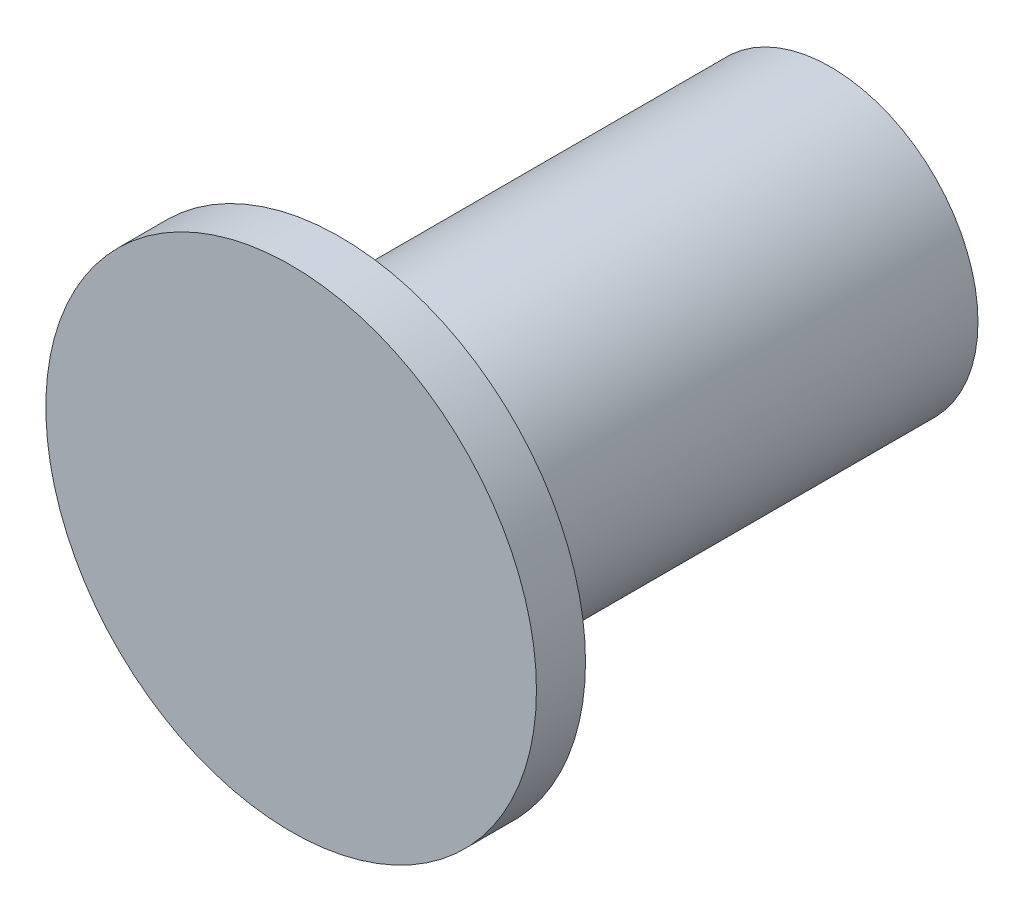
ISO-10303-21;
HEADER;
FILE_DESCRIPTION(('STEP AP214'),'2;1');
FILE_NAME('part.step','',(''),(''),'','','');
FILE_SCHEMA(('AUTOMOTIVE_DESIGN { 1 0 10303 214 1 1 1 1 }'));
ENDSEC;
DATA;
#1=APPLICATION_CONTEXT('core data for automotive mechanical design processes');
#2=APPLICATION_PROTOCOL_DEFINITION('international standard','automotive_design',2000,#1);
#3=PRODUCT_CONTEXT('',#1,'mechanical');
#4=PRODUCT('Part','Part','',(#3));
#5=PRODUCT_RELATED_PRODUCT_CATEGORY('part','',(#4));
#6=PRODUCT_DEFINITION_FORMATION('','',#4);
#7=PRODUCT_DEFINITION_CONTEXT('part definition',#1,'design');
#8=PRODUCT_DEFINITION('design','',#6,#7);
#9=PRODUCT_DEFINITION_SHAPE('','',#8);
#10=(LENGTH_UNIT() NAMED_UNIT(*) SI_UNIT(.MILLI.,.METRE.));
#11=(NAMED_UNIT(*) PLANE_ANGLE_UNIT() SI_UNIT($,.RADIAN.));
#12=(NAMED_UNIT(*) SI_UNIT($,.STERADIAN.) SOLID_ANGLE_UNIT());
#13=UNCERTAINTY_MEASURE_WITH_UNIT(LENGTH_MEASURE(1.E-05),#10,'distance_accuracy_value','');
#14=(GEOMETRIC_REPRESENTATION_CONTEXT(3) GLOBAL_UNCERTAINTY_ASSIGNED_CONTEXT((#13)) GLOBAL_UNIT_ASSIGNED_CONTEXT((#10,
#11,#12)) REPRESENTATION_CONTEXT('',''));
#15=CARTESIAN_POINT('',(0.,0.,0.));
#16=DIRECTION('',(0.,0.,1.));
#17=DIRECTION('',(1.,0.,0.));
#18=AXIS2_PLACEMENT_3D('',#15,#16,#17);
#19=CARTESIAN_POINT('',(0.,0.,1.));
#20=DIRECTION('',(0.,0.,-1.));
#21=DIRECTION('',(-1.,0.,0.));
#22=AXIS2_PLACEMENT_3D('',#19,#20,#21);
#23=CYLINDRICAL_SURFACE('',#22,0.3);
#24=CARTESIAN_POINT('',(0.,0.,1.));
#25=DIRECTION('',(0.,0.,1.));
#26=DIRECTION('',(1.,0.,0.));
#27=AXIS2_PLACEMENT_3D('',#24,#25,#26);
#28=CIRCLE('',#27,0.3);
#29=CARTESIAN_POINT('',(0.3,0.,1.));
#30=VERTEX_POINT('',#29);
#31=EDGE_CURVE('E10',#30,#30,#28,.T.);
#32=ORIENTED_EDGE('',*,*,#31,.F.);
#33=EDGE_LOOP('',(#32));
#34=FACE_BOUND('',#33,.T.);
#35=CARTESIAN_POINT('',(0.,0.,0.));
#36=DIRECTION('',(0.,0.,1.));
#37=DIRECTION('',(1.,0.,0.));
#38=AXIS2_PLACEMENT_3D('',#35,#36,#37);
#39=CIRCLE('',#38,0.3);
#40=CARTESIAN_POINT('',(0.3,0.,0.));
#41=VERTEX_POINT('',#40);
#42=EDGE_CURVE('E35',#41,#41,#39,.T.);
#43=ORIENTED_EDGE('',*,*,#42,.T.);
#44=EDGE_LOOP('',(#43));
#45=FACE_BOUND('',#44,.T.);
#46=ADVANCED_FACE('F32',(#34,#45),#23,.T.);
#47=CARTESIAN_POINT('',(0.,0.,0.));
#48=DIRECTION('',(0.,0.,1.));
#49=DIRECTION('',(1.,0.,0.));
#50=AXIS2_PLACEMENT_3D('',#47,#48,#49);
#51=PLANE('',#50);
#52=ORIENTED_EDGE('',*,*,#42,.F.);
#53=EDGE_LOOP('',(#52));
#54=FACE_BOUND('',#53,.T.);
#55=ADVANCED_FACE('F55',(#54),#51,.F.);
#56=CARTESIAN_POINT('',(0.,0.,1.1));
#57=DIRECTION('',(0.,0.,-1.));
#58=DIRECTION('',(-1.,0.,0.));
#59=AXIS2_PLACEMENT_3D('',#56,#57,#58);
#60=CYLINDRICAL_SURFACE('',#59,0.5);
#61=CARTESIAN_POINT('',(0.,0.,1.1));
#62=DIRECTION('',(0.,0.,1.));
#63=DIRECTION('',(1.,0.,0.));
#64=AXIS2_PLACEMENT_3D('',#61,#62,#63);
#65=CIRCLE('',#64,0.5);
#66=CARTESIAN_POINT('',(0.5,0.,1.1));
#67=VERTEX_POINT('',#66);
#68=EDGE_CURVE('E42',#67,#67,#65,.T.);
#69=ORIENTED_EDGE('',*,*,#68,.F.);
#70=EDGE_LOOP('',(#69));
#71=FACE_BOUND('',#70,.T.);
#72=CARTESIAN_POINT('',(0.,0.,1.));
#73=DIRECTION('',(0.,0.,1.));
#74=DIRECTION('',(1.,0.,0.));
#75=AXIS2_PLACEMENT_3D('',#72,#73,#74);
#76=CIRCLE('',#75,0.5);
#77=CARTESIAN_POINT('',(0.5,0.,1.));
#78=VERTEX_POINT('',#77);
#79=EDGE_CURVE('E44',#78,#78,#76,.T.);
#80=ORIENTED_EDGE('',*,*,#79,.T.);
#81=EDGE_LOOP('',(#80));
#82=FACE_BOUND('',#81,.T.);
#83=ADVANCED_FACE('F52',(#71,#82),#60,.T.);
#84=CARTESIAN_POINT('',(0.,0.,1.1));
#85=DIRECTION('',(0.,0.,1.));
#86=DIRECTION('',(1.,0.,0.));
#87=AXIS2_PLACEMENT_3D('',#84,#85,#86);
#88=PLANE('',#87);
#89=ORIENTED_EDGE('',*,*,#68,.T.);
#90=EDGE_LOOP('',(#89));
#91=FACE_BOUND('',#90,.T.);
#92=ADVANCED_FACE('F50',(#91),#88,.T.);
#93=CARTESIAN_POINT('',(0.,0.,1.));
#94=DIRECTION('',(0.,0.,1.));
#95=DIRECTION('',(1.,0.,0.));
#96=AXIS2_PLACEMENT_3D('',#93,#94,#95);
#97=PLANE('',#96);
#98=ORIENTED_EDGE('',*,*,#31,.T.);
#99=EDGE_LOOP('',(#98));
#100=FACE_BOUND('',#99,.T.);
#101=ORIENTED_EDGE('',*,*,#79,.F.);
#102=EDGE_LOOP('',(#101));
#103=FACE_BOUND('',#102,.T.);
#104=ADVANCED_FACE('F59',(#100,#103),#97,.F.);
#105=CLOSED_SHELL('',(#46,#55,#83,#92,#104));
#106=MANIFOLD_SOLID_BREP('B2',#105);
#107=ADVANCED_BREP_SHAPE_REPRESENTATION('',(#18,#106),#14);
#108=SHAPE_DEFINITION_REPRESENTATION(#9,#107);
ENDSEC;
END-ISO-10303-21;
